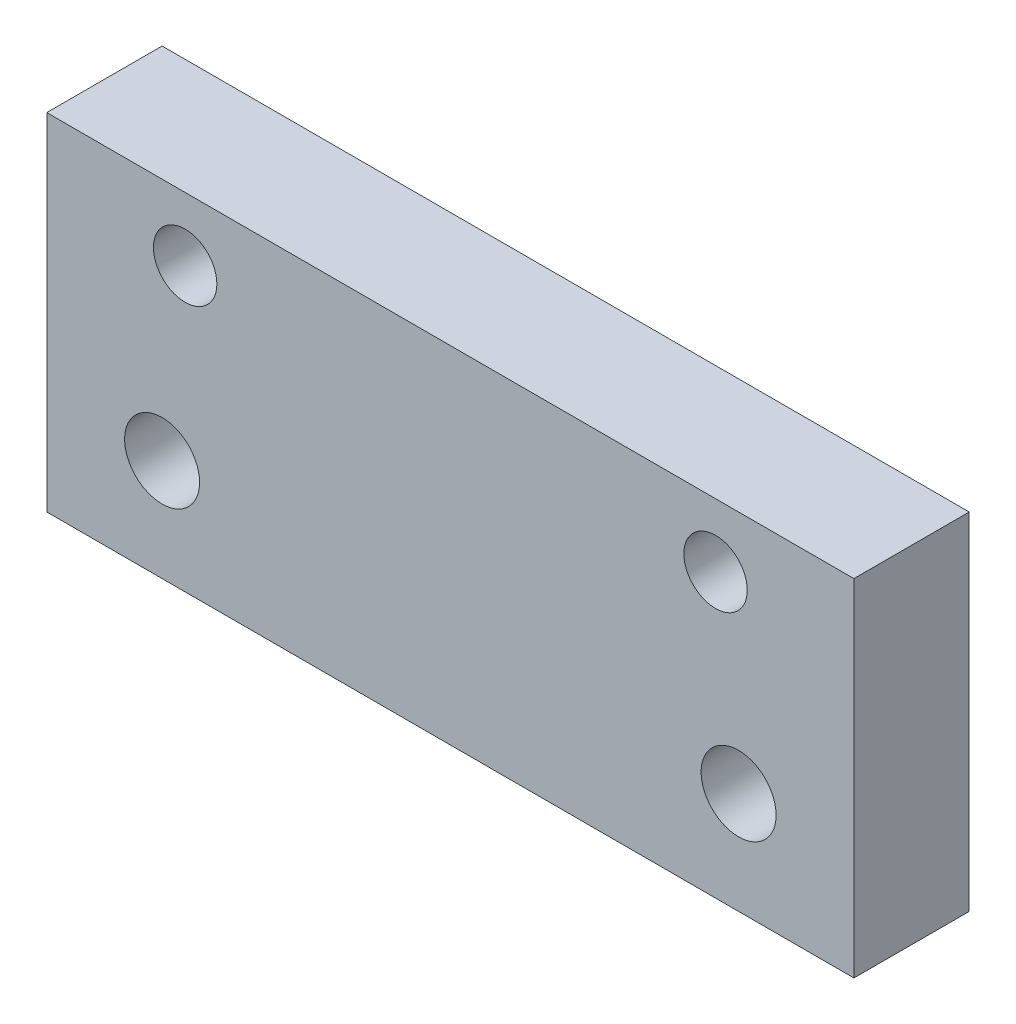
ISO-10303-21;
HEADER;
FILE_DESCRIPTION(('STEP AP214'),'2;1');
FILE_NAME('part.step','',(''),(''),'','','');
FILE_SCHEMA(('AUTOMOTIVE_DESIGN { 1 0 10303 214 1 1 1 1 }'));
ENDSEC;
DATA;
#1=APPLICATION_CONTEXT('core data for automotive mechanical design processes');
#2=APPLICATION_PROTOCOL_DEFINITION('international standard','automotive_design',2000,#1);
#3=PRODUCT_CONTEXT('',#1,'mechanical');
#4=PRODUCT('Part','Part','',(#3));
#5=PRODUCT_RELATED_PRODUCT_CATEGORY('part','',(#4));
#6=PRODUCT_DEFINITION_FORMATION('','',#4);
#7=PRODUCT_DEFINITION_CONTEXT('part definition',#1,'design');
#8=PRODUCT_DEFINITION('design','',#6,#7);
#9=PRODUCT_DEFINITION_SHAPE('','',#8);
#10=(LENGTH_UNIT() NAMED_UNIT(*) SI_UNIT(.MILLI.,.METRE.));
#11=(NAMED_UNIT(*) PLANE_ANGLE_UNIT() SI_UNIT($,.RADIAN.));
#12=(NAMED_UNIT(*) SI_UNIT($,.STERADIAN.) SOLID_ANGLE_UNIT());
#13=UNCERTAINTY_MEASURE_WITH_UNIT(LENGTH_MEASURE(1.E-05),#10,'distance_accuracy_value','');
#14=(GEOMETRIC_REPRESENTATION_CONTEXT(3) GLOBAL_UNCERTAINTY_ASSIGNED_CONTEXT((#13)) GLOBAL_UNIT_ASSIGNED_CONTEXT((#10,
#11,#12)) REPRESENTATION_CONTEXT('',''));
#15=CARTESIAN_POINT('',(0.,0.,0.));
#16=DIRECTION('',(0.,0.,1.));
#17=DIRECTION('',(1.,0.,0.));
#18=AXIS2_PLACEMENT_3D('',#15,#16,#17);
#19=CARTESIAN_POINT('',(-23.,9.50000000000001,10.));
#20=DIRECTION('',(0.,0.,-1.));
#21=DIRECTION('',(-1.,0.,0.));
#22=AXIS2_PLACEMENT_3D('',#19,#20,#21);
#23=CYLINDRICAL_SURFACE('',#22,2.75);
#24=CARTESIAN_POINT('',(-23.,9.50000000000001,10.));
#25=DIRECTION('',(0.,0.,1.));
#26=DIRECTION('',(1.,0.,0.));
#27=AXIS2_PLACEMENT_3D('',#24,#25,#26);
#28=CIRCLE('',#27,2.75);
#29=CARTESIAN_POINT('',(-20.25,9.50000000000001,10.));
#30=VERTEX_POINT('',#29);
#31=EDGE_CURVE('E116',#30,#30,#28,.T.);
#32=ORIENTED_EDGE('',*,*,#31,.T.);
#33=EDGE_LOOP('',(#32));
#34=FACE_BOUND('',#33,.T.);
#35=CARTESIAN_POINT('',(-23.,9.50000000000001,5.4));
#36=DIRECTION('',(0.,0.,-1.));
#37=DIRECTION('',(-1.,0.,0.));
#38=AXIS2_PLACEMENT_3D('',#35,#36,#37);
#39=CIRCLE('',#38,2.75);
#40=CARTESIAN_POINT('',(-25.75,9.50000000000001,5.4));
#41=VERTEX_POINT('',#40);
#42=EDGE_CURVE('E37',#41,#41,#39,.T.);
#43=ORIENTED_EDGE('',*,*,#42,.T.);
#44=EDGE_LOOP('',(#43));
#45=FACE_BOUND('',#44,.T.);
#46=ADVANCED_FACE('F33',(#34,#45),#23,.F.);
#47=CARTESIAN_POINT('',(23.,9.50000000000001,10.));
#48=DIRECTION('',(0.,0.,-1.));
#49=DIRECTION('',(-1.,0.,0.));
#50=AXIS2_PLACEMENT_3D('',#47,#48,#49);
#51=CYLINDRICAL_SURFACE('',#50,2.75);
#52=CARTESIAN_POINT('',(23.,9.50000000000001,10.));
#53=DIRECTION('',(0.,0.,1.));
#54=DIRECTION('',(1.,0.,0.));
#55=AXIS2_PLACEMENT_3D('',#52,#53,#54);
#56=CIRCLE('',#55,2.75);
#57=CARTESIAN_POINT('',(25.75,9.50000000000001,10.));
#58=VERTEX_POINT('',#57);
#59=EDGE_CURVE('E111',#58,#58,#56,.T.);
#60=ORIENTED_EDGE('',*,*,#59,.T.);
#61=EDGE_LOOP('',(#60));
#62=FACE_BOUND('',#61,.T.);
#63=CARTESIAN_POINT('',(23.,9.50000000000001,5.4));
#64=DIRECTION('',(0.,0.,-1.));
#65=DIRECTION('',(-1.,0.,0.));
#66=AXIS2_PLACEMENT_3D('',#63,#64,#65);
#67=CIRCLE('',#66,2.75);
#68=CARTESIAN_POINT('',(20.25,9.50000000000001,5.4));
#69=VERTEX_POINT('',#68);
#70=EDGE_CURVE('E109',#69,#69,#67,.T.);
#71=ORIENTED_EDGE('',*,*,#70,.T.);
#72=EDGE_LOOP('',(#71));
#73=FACE_BOUND('',#72,.T.);
#74=ADVANCED_FACE('F162',(#62,#73),#51,.F.);
#75=CARTESIAN_POINT('',(0.,0.,10.));
#76=DIRECTION('',(0.,0.,1.));
#77=DIRECTION('',(1.,0.,0.));
#78=AXIS2_PLACEMENT_3D('',#75,#76,#77);
#79=PLANE('',#78);
#80=ORIENTED_EDGE('',*,*,#31,.F.);
#81=EDGE_LOOP('',(#80));
#82=FACE_BOUND('',#81,.T.);
#83=CARTESIAN_POINT('',(-25.,-6.15036231884059,10.));
#84=DIRECTION('',(0.,0.,1.));
#85=DIRECTION('',(1.,0.,0.));
#86=AXIS2_PLACEMENT_3D('',#83,#84,#85);
#87=CIRCLE('',#86,3.25);
#88=CARTESIAN_POINT('',(-21.75,-6.15036231884059,10.));
#89=VERTEX_POINT('',#88);
#90=EDGE_CURVE('E104',#89,#89,#87,.T.);
#91=ORIENTED_EDGE('',*,*,#90,.F.);
#92=EDGE_LOOP('',(#91));
#93=FACE_BOUND('',#92,.T.);
#94=DIRECTION('',(0.,1.,0.));
#95=VECTOR('',#94,1.);
#96=CARTESIAN_POINT('',(35.,15.,10.));
#97=LINE('',#96,#95);
#98=CARTESIAN_POINT('',(35.,-15.,10.));
#99=VERTEX_POINT('',#98);
#100=CARTESIAN_POINT('',(35.,15.,10.));
#101=VERTEX_POINT('',#100);
#102=EDGE_CURVE('E88',#99,#101,#97,.T.);
#103=ORIENTED_EDGE('',*,*,#102,.T.);
#104=DIRECTION('',(-1.,0.,0.));
#105=VECTOR('',#104,1.);
#106=CARTESIAN_POINT('',(-35.,15.,10.));
#107=LINE('',#106,#105);
#108=CARTESIAN_POINT('',(-35.,15.,10.));
#109=VERTEX_POINT('',#108);
#110=EDGE_CURVE('E82',#101,#109,#107,.T.);
#111=ORIENTED_EDGE('',*,*,#110,.T.);
#112=DIRECTION('',(0.,-1.,0.));
#113=VECTOR('',#112,1.);
#114=CARTESIAN_POINT('',(-35.,15.,10.));
#115=LINE('',#114,#113);
#116=CARTESIAN_POINT('',(-35.,-15.,10.));
#117=VERTEX_POINT('',#116);
#118=EDGE_CURVE('E86',#109,#117,#115,.T.);
#119=ORIENTED_EDGE('',*,*,#118,.T.);
#120=DIRECTION('',(1.,0.,0.));
#121=VECTOR('',#120,1.);
#122=CARTESIAN_POINT('',(-35.,-15.,10.));
#123=LINE('',#122,#121);
#124=EDGE_CURVE('E52',#117,#99,#123,.T.);
#125=ORIENTED_EDGE('',*,*,#124,.T.);
#126=EDGE_LOOP('',(#103,#111,#119,#125));
#127=FACE_BOUND('',#126,.T.);
#128=CARTESIAN_POINT('',(25.,-6.15036231884058,10.));
#129=DIRECTION('',(0.,0.,1.));
#130=DIRECTION('',(1.,0.,0.));
#131=AXIS2_PLACEMENT_3D('',#128,#129,#130);
#132=CIRCLE('',#131,3.25);
#133=CARTESIAN_POINT('',(28.25,-6.15036231884058,10.));
#134=VERTEX_POINT('',#133);
#135=EDGE_CURVE('E132',#134,#134,#132,.T.);
#136=ORIENTED_EDGE('',*,*,#135,.F.);
#137=EDGE_LOOP('',(#136));
#138=FACE_BOUND('',#137,.T.);
#139=ORIENTED_EDGE('',*,*,#59,.F.);
#140=EDGE_LOOP('',(#139));
#141=FACE_BOUND('',#140,.T.);
#142=ADVANCED_FACE('F83',(#82,#93,#127,#138,#141),#79,.T.);
#143=CARTESIAN_POINT('',(0.,0.,0.));
#144=DIRECTION('',(0.,0.,1.));
#145=DIRECTION('',(1.,0.,0.));
#146=AXIS2_PLACEMENT_3D('',#143,#144,#145);
#147=PLANE('',#146);
#148=CARTESIAN_POINT('',(-23.,9.50000000000001,0.));
#149=DIRECTION('',(0.,0.,-1.));
#150=DIRECTION('',(-1.,0.,0.));
#151=AXIS2_PLACEMENT_3D('',#148,#149,#150);
#152=CIRCLE('',#151,5.);
#153=CARTESIAN_POINT('',(-28.,9.50000000000001,0.));
#154=VERTEX_POINT('',#153);
#155=EDGE_CURVE('E126',#154,#154,#152,.T.);
#156=ORIENTED_EDGE('',*,*,#155,.F.);
#157=EDGE_LOOP('',(#156));
#158=FACE_BOUND('',#157,.T.);
#159=CARTESIAN_POINT('',(23.,9.50000000000001,0.));
#160=DIRECTION('',(0.,0.,-1.));
#161=DIRECTION('',(-1.,0.,0.));
#162=AXIS2_PLACEMENT_3D('',#159,#160,#161);
#163=CIRCLE('',#162,5.);
#164=CARTESIAN_POINT('',(18.,9.50000000000001,0.));
#165=VERTEX_POINT('',#164);
#166=EDGE_CURVE('E119',#165,#165,#163,.T.);
#167=ORIENTED_EDGE('',*,*,#166,.F.);
#168=EDGE_LOOP('',(#167));
#169=FACE_BOUND('',#168,.T.);
#170=DIRECTION('',(0.,1.,0.));
#171=VECTOR('',#170,1.);
#172=CARTESIAN_POINT('',(35.,15.,0.));
#173=LINE('',#172,#171);
#174=CARTESIAN_POINT('',(35.,-15.,0.));
#175=VERTEX_POINT('',#174);
#176=CARTESIAN_POINT('',(35.,15.,0.));
#177=VERTEX_POINT('',#176);
#178=EDGE_CURVE('E101',#175,#177,#173,.T.);
#179=ORIENTED_EDGE('',*,*,#178,.F.);
#180=DIRECTION('',(1.,0.,0.));
#181=VECTOR('',#180,1.);
#182=CARTESIAN_POINT('',(-35.,-15.,0.));
#183=LINE('',#182,#181);
#184=CARTESIAN_POINT('',(-35.,-15.,0.));
#185=VERTEX_POINT('',#184);
#186=EDGE_CURVE('E75',#185,#175,#183,.T.);
#187=ORIENTED_EDGE('',*,*,#186,.F.);
#188=DIRECTION('',(0.,-1.,0.));
#189=VECTOR('',#188,1.);
#190=CARTESIAN_POINT('',(-35.,15.,0.));
#191=LINE('',#190,#189);
#192=CARTESIAN_POINT('',(-35.,15.,0.));
#193=VERTEX_POINT('',#192);
#194=EDGE_CURVE('E69',#193,#185,#191,.T.);
#195=ORIENTED_EDGE('',*,*,#194,.F.);
#196=DIRECTION('',(-1.,0.,0.));
#197=VECTOR('',#196,1.);
#198=CARTESIAN_POINT('',(-35.,15.,0.));
#199=LINE('',#198,#197);
#200=EDGE_CURVE('E92',#177,#193,#199,.T.);
#201=ORIENTED_EDGE('',*,*,#200,.F.);
#202=EDGE_LOOP('',(#179,#187,#195,#201));
#203=FACE_BOUND('',#202,.T.);
#204=CARTESIAN_POINT('',(-25.,-6.15036231884059,0.));
#205=DIRECTION('',(0.,0.,1.));
#206=DIRECTION('',(1.,0.,0.));
#207=AXIS2_PLACEMENT_3D('',#204,#205,#206);
#208=CIRCLE('',#207,3.25);
#209=CARTESIAN_POINT('',(-21.75,-6.15036231884059,0.));
#210=VERTEX_POINT('',#209);
#211=EDGE_CURVE('E135',#210,#210,#208,.T.);
#212=ORIENTED_EDGE('',*,*,#211,.T.);
#213=EDGE_LOOP('',(#212));
#214=FACE_BOUND('',#213,.T.);
#215=CARTESIAN_POINT('',(25.,-6.15036231884058,0.));
#216=DIRECTION('',(0.,0.,1.));
#217=DIRECTION('',(1.,0.,0.));
#218=AXIS2_PLACEMENT_3D('',#215,#216,#217);
#219=CIRCLE('',#218,3.25);
#220=CARTESIAN_POINT('',(28.25,-6.15036231884058,0.));
#221=VERTEX_POINT('',#220);
#222=EDGE_CURVE('E131',#221,#221,#219,.T.);
#223=ORIENTED_EDGE('',*,*,#222,.T.);
#224=EDGE_LOOP('',(#223));
#225=FACE_BOUND('',#224,.T.);
#226=ADVANCED_FACE('F143',(#158,#169,#203,#214,#225),#147,.F.);
#227=CARTESIAN_POINT('',(35.,15.,10.));
#228=DIRECTION('',(-1.,0.,0.));
#229=DIRECTION('',(0.,-1.,0.));
#230=AXIS2_PLACEMENT_3D('',#227,#228,#229);
#231=PLANE('',#230);
#232=ORIENTED_EDGE('',*,*,#178,.T.);
#233=DIRECTION('',(0.,0.,-1.));
#234=VECTOR('',#233,1.);
#235=CARTESIAN_POINT('',(35.,15.,10.));
#236=LINE('',#235,#234);
#237=EDGE_CURVE('E11',#101,#177,#236,.T.);
#238=ORIENTED_EDGE('',*,*,#237,.F.);
#239=ORIENTED_EDGE('',*,*,#102,.F.);
#240=DIRECTION('',(0.,0.,-1.));
#241=VECTOR('',#240,1.);
#242=CARTESIAN_POINT('',(35.,-15.,10.));
#243=LINE('',#242,#241);
#244=EDGE_CURVE('E97',#99,#175,#243,.T.);
#245=ORIENTED_EDGE('',*,*,#244,.T.);
#246=EDGE_LOOP('',(#232,#238,#239,#245));
#247=FACE_BOUND('',#246,.T.);
#248=ADVANCED_FACE('F35',(#247),#231,.F.);
#249=CARTESIAN_POINT('',(-35.,15.,10.));
#250=DIRECTION('',(0.,-1.,0.));
#251=DIRECTION('',(0.,0.,-1.));
#252=AXIS2_PLACEMENT_3D('',#249,#250,#251);
#253=PLANE('',#252);
#254=ORIENTED_EDGE('',*,*,#200,.T.);
#255=DIRECTION('',(0.,0.,-1.));
#256=VECTOR('',#255,1.);
#257=CARTESIAN_POINT('',(-35.,15.,10.));
#258=LINE('',#257,#256);
#259=EDGE_CURVE('E43',#109,#193,#258,.T.);
#260=ORIENTED_EDGE('',*,*,#259,.F.);
#261=ORIENTED_EDGE('',*,*,#110,.F.);
#262=ORIENTED_EDGE('',*,*,#237,.T.);
#263=EDGE_LOOP('',(#254,#260,#261,#262));
#264=FACE_BOUND('',#263,.T.);
#265=ADVANCED_FACE('F91',(#264),#253,.F.);
#266=CARTESIAN_POINT('',(-35.,15.,10.));
#267=DIRECTION('',(1.,0.,0.));
#268=DIRECTION('',(0.,1.,0.));
#269=AXIS2_PLACEMENT_3D('',#266,#267,#268);
#270=PLANE('',#269);
#271=ORIENTED_EDGE('',*,*,#194,.T.);
#272=DIRECTION('',(0.,0.,-1.));
#273=VECTOR('',#272,1.);
#274=CARTESIAN_POINT('',(-35.,-15.,10.));
#275=LINE('',#274,#273);
#276=EDGE_CURVE('E93',#117,#185,#275,.T.);
#277=ORIENTED_EDGE('',*,*,#276,.F.);
#278=ORIENTED_EDGE('',*,*,#118,.F.);
#279=ORIENTED_EDGE('',*,*,#259,.T.);
#280=EDGE_LOOP('',(#271,#277,#278,#279));
#281=FACE_BOUND('',#280,.T.);
#282=ADVANCED_FACE('F95',(#281),#270,.F.);
#283=CARTESIAN_POINT('',(-35.,-15.,10.));
#284=DIRECTION('',(0.,1.,0.));
#285=DIRECTION('',(0.,0.,1.));
#286=AXIS2_PLACEMENT_3D('',#283,#284,#285);
#287=PLANE('',#286);
#288=ORIENTED_EDGE('',*,*,#186,.T.);
#289=ORIENTED_EDGE('',*,*,#244,.F.);
#290=ORIENTED_EDGE('',*,*,#124,.F.);
#291=ORIENTED_EDGE('',*,*,#276,.T.);
#292=EDGE_LOOP('',(#288,#289,#290,#291));
#293=FACE_BOUND('',#292,.T.);
#294=ADVANCED_FACE('F149',(#293),#287,.F.);
#295=CARTESIAN_POINT('',(-25.,-6.15036231884059,10.));
#296=DIRECTION('',(0.,0.,-1.));
#297=DIRECTION('',(-1.,0.,0.));
#298=AXIS2_PLACEMENT_3D('',#295,#296,#297);
#299=CYLINDRICAL_SURFACE('',#298,3.25);
#300=ORIENTED_EDGE('',*,*,#90,.T.);
#301=EDGE_LOOP('',(#300));
#302=FACE_BOUND('',#301,.T.);
#303=ORIENTED_EDGE('',*,*,#211,.F.);
#304=EDGE_LOOP('',(#303));
#305=FACE_BOUND('',#304,.T.);
#306=ADVANCED_FACE('F146',(#302,#305),#299,.F.);
#307=CARTESIAN_POINT('',(25.,-6.15036231884058,10.));
#308=DIRECTION('',(0.,0.,-1.));
#309=DIRECTION('',(-1.,0.,0.));
#310=AXIS2_PLACEMENT_3D('',#307,#308,#309);
#311=CYLINDRICAL_SURFACE('',#310,3.25);
#312=ORIENTED_EDGE('',*,*,#135,.T.);
#313=EDGE_LOOP('',(#312));
#314=FACE_BOUND('',#313,.T.);
#315=ORIENTED_EDGE('',*,*,#222,.F.);
#316=EDGE_LOOP('',(#315));
#317=FACE_BOUND('',#316,.T.);
#318=ADVANCED_FACE('F148',(#314,#317),#311,.F.);
#319=CARTESIAN_POINT('',(23.,9.50000000000001,5.4));
#320=DIRECTION('',(0.,0.,-1.));
#321=DIRECTION('',(-1.,0.,0.));
#322=AXIS2_PLACEMENT_3D('',#319,#320,#321);
#323=CYLINDRICAL_SURFACE('',#322,5.);
#324=CARTESIAN_POINT('',(23.,9.50000000000001,5.4));
#325=DIRECTION('',(0.,0.,-1.));
#326=DIRECTION('',(-1.,0.,0.));
#327=AXIS2_PLACEMENT_3D('',#324,#325,#326);
#328=CIRCLE('',#327,5.);
#329=CARTESIAN_POINT('',(18.,9.50000000000001,5.4));
#330=VERTEX_POINT('',#329);
#331=EDGE_CURVE('E112',#330,#330,#328,.T.);
#332=ORIENTED_EDGE('',*,*,#331,.F.);
#333=EDGE_LOOP('',(#332));
#334=FACE_BOUND('',#333,.T.);
#335=ORIENTED_EDGE('',*,*,#166,.T.);
#336=EDGE_LOOP('',(#335));
#337=FACE_BOUND('',#336,.T.);
#338=ADVANCED_FACE('F156',(#334,#337),#323,.F.);
#339=CARTESIAN_POINT('',(23.,9.50000000000001,5.4));
#340=DIRECTION('',(0.,0.,-1.));
#341=DIRECTION('',(-1.,0.,0.));
#342=AXIS2_PLACEMENT_3D('',#339,#340,#341);
#343=PLANE('',#342);
#344=ORIENTED_EDGE('',*,*,#70,.F.);
#345=EDGE_LOOP('',(#344));
#346=FACE_BOUND('',#345,.T.);
#347=ORIENTED_EDGE('',*,*,#331,.T.);
#348=EDGE_LOOP('',(#347));
#349=FACE_BOUND('',#348,.T.);
#350=ADVANCED_FACE('F174',(#346,#349),#343,.T.);
#351=CARTESIAN_POINT('',(-23.,9.50000000000001,5.4));
#352=DIRECTION('',(0.,0.,-1.));
#353=DIRECTION('',(-1.,0.,0.));
#354=AXIS2_PLACEMENT_3D('',#351,#352,#353);
#355=CYLINDRICAL_SURFACE('',#354,5.);
#356=CARTESIAN_POINT('',(-23.,9.50000000000001,5.4));
#357=DIRECTION('',(0.,0.,-1.));
#358=DIRECTION('',(-1.,0.,0.));
#359=AXIS2_PLACEMENT_3D('',#356,#357,#358);
#360=CIRCLE('',#359,5.);
#361=CARTESIAN_POINT('',(-28.,9.50000000000001,5.4));
#362=VERTEX_POINT('',#361);
#363=EDGE_CURVE('E193',#362,#362,#360,.T.);
#364=ORIENTED_EDGE('',*,*,#363,.F.);
#365=EDGE_LOOP('',(#364));
#366=FACE_BOUND('',#365,.T.);
#367=ORIENTED_EDGE('',*,*,#155,.T.);
#368=EDGE_LOOP('',(#367));
#369=FACE_BOUND('',#368,.T.);
#370=ADVANCED_FACE('F178',(#366,#369),#355,.F.);
#371=CARTESIAN_POINT('',(-23.,9.50000000000001,5.4));
#372=DIRECTION('',(0.,0.,-1.));
#373=DIRECTION('',(-1.,0.,0.));
#374=AXIS2_PLACEMENT_3D('',#371,#372,#373);
#375=PLANE('',#374);
#376=ORIENTED_EDGE('',*,*,#42,.F.);
#377=EDGE_LOOP('',(#376));
#378=FACE_BOUND('',#377,.T.);
#379=ORIENTED_EDGE('',*,*,#363,.T.);
#380=EDGE_LOOP('',(#379));
#381=FACE_BOUND('',#380,.T.);
#382=ADVANCED_FACE('F182',(#378,#381),#375,.T.);
#383=CLOSED_SHELL('',(#46,#74,#142,#226,#248,#265,#282,#294,#306,#318,#338,#350,#370,#382));
#384=MANIFOLD_SOLID_BREP('B2',#383);
#385=ADVANCED_BREP_SHAPE_REPRESENTATION('',(#18,#384),#14);
#386=SHAPE_DEFINITION_REPRESENTATION(#9,#385);
ENDSEC;
END-ISO-10303-21;
